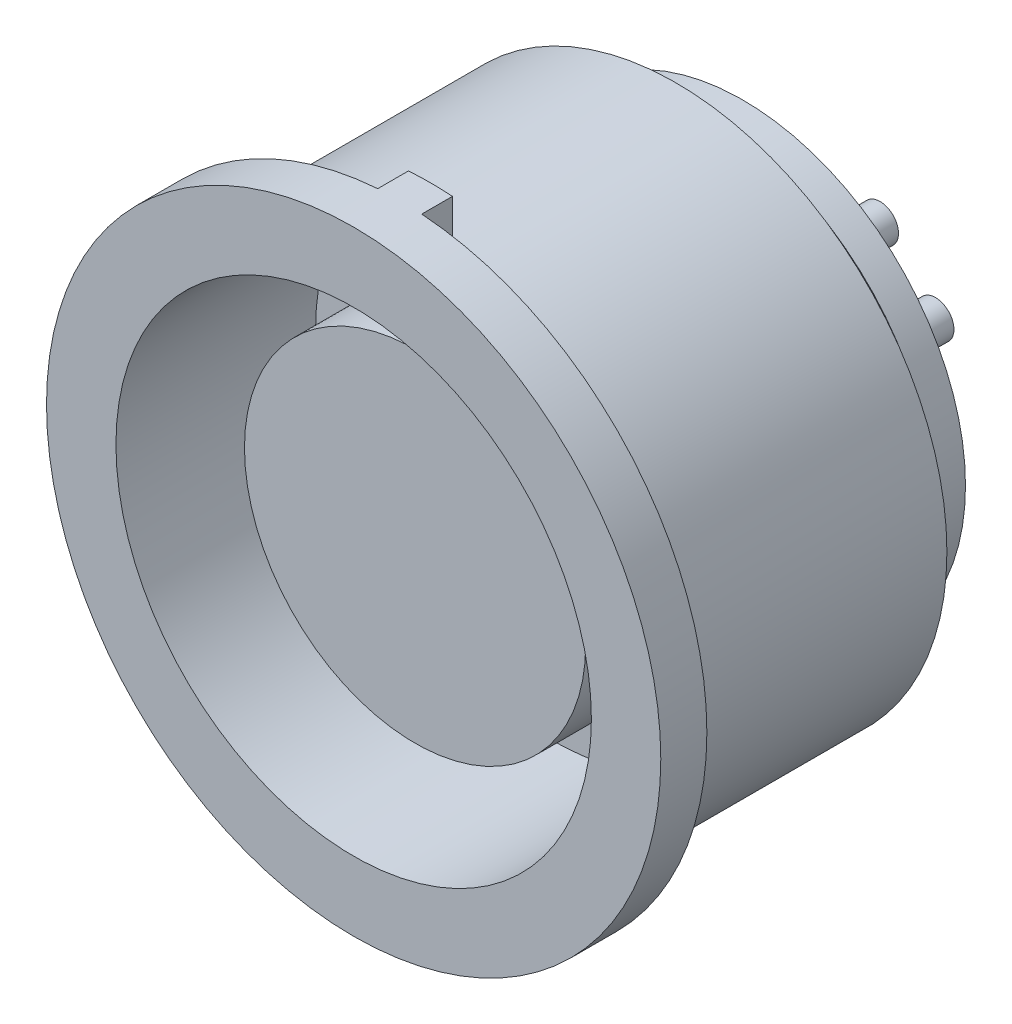
ISO-10303-21;
HEADER;
FILE_DESCRIPTION(('STEP AP214'),'2;1');
FILE_NAME('part.step','',(''),(''),'','','');
FILE_SCHEMA(('AUTOMOTIVE_DESIGN { 1 0 10303 214 1 1 1 1 }'));
ENDSEC;
DATA;
#1=APPLICATION_CONTEXT('core data for automotive mechanical design processes');
#2=APPLICATION_PROTOCOL_DEFINITION('international standard','automotive_design',2000,#1);
#3=PRODUCT_CONTEXT('',#1,'mechanical');
#4=PRODUCT('Part','Part','',(#3));
#5=PRODUCT_RELATED_PRODUCT_CATEGORY('part','',(#4));
#6=PRODUCT_DEFINITION_FORMATION('','',#4);
#7=PRODUCT_DEFINITION_CONTEXT('part definition',#1,'design');
#8=PRODUCT_DEFINITION('design','',#6,#7);
#9=PRODUCT_DEFINITION_SHAPE('','',#8);
#10=(LENGTH_UNIT() NAMED_UNIT(*) SI_UNIT(.MILLI.,.METRE.));
#11=(NAMED_UNIT(*) PLANE_ANGLE_UNIT() SI_UNIT($,.RADIAN.));
#12=(NAMED_UNIT(*) SI_UNIT($,.STERADIAN.) SOLID_ANGLE_UNIT());
#13=UNCERTAINTY_MEASURE_WITH_UNIT(LENGTH_MEASURE(1.E-05),#10,'distance_accuracy_value','');
#14=(GEOMETRIC_REPRESENTATION_CONTEXT(3) GLOBAL_UNCERTAINTY_ASSIGNED_CONTEXT((#13)) GLOBAL_UNIT_ASSIGNED_CONTEXT((#10,
#11,#12)) REPRESENTATION_CONTEXT('',''));
#15=CARTESIAN_POINT('',(0.,0.,0.));
#16=DIRECTION('',(0.,0.,1.));
#17=DIRECTION('',(1.,0.,0.));
#18=AXIS2_PLACEMENT_3D('',#15,#16,#17);
#19=CARTESIAN_POINT('',(0.,0.,11.3571428571429));
#20=DIRECTION('',(0.,0.,1.));
#21=DIRECTION('',(1.,0.,0.));
#22=AXIS2_PLACEMENT_3D('',#19,#20,#21);
#23=CYLINDRICAL_SURFACE('',#22,8.815);
#24=CARTESIAN_POINT('',(0.,0.,-9.));
#25=DIRECTION('',(0.,0.,1.));
#26=DIRECTION('',(1.,0.,0.));
#27=AXIS2_PLACEMENT_3D('',#24,#25,#26);
#28=CIRCLE('',#27,8.815);
#29=CARTESIAN_POINT('',(8.815,0.,-9.));
#30=VERTEX_POINT('',#29);
#31=EDGE_CURVE('E161',#30,#30,#28,.T.);
#32=ORIENTED_EDGE('',*,*,#31,.T.);
#33=EDGE_LOOP('',(#32));
#34=FACE_BOUND('',#33,.T.);
#35=DIRECTION('',(0.,0.,1.));
#36=VECTOR('',#35,1.);
#37=CARTESIAN_POINT('',(0.716714940094325,8.78581497043078,-1.));
#38=LINE('',#37,#36);
#39=CARTESIAN_POINT('',(0.716714940094325,8.78581497043078,-0.999999999999999));
#40=VERTEX_POINT('',#39);
#41=CARTESIAN_POINT('',(0.716714940094325,8.78581497043078,0.));
#42=VERTEX_POINT('',#41);
#43=EDGE_CURVE('E80',#40,#42,#38,.T.);
#44=ORIENTED_EDGE('',*,*,#43,.T.);
#45=CARTESIAN_POINT('',(0.,0.,0.));
#46=DIRECTION('',(0.,0.,1.));
#47=DIRECTION('',(1.,0.,0.));
#48=AXIS2_PLACEMENT_3D('',#45,#46,#47);
#49=CIRCLE('',#48,8.815);
#50=CARTESIAN_POINT('',(-0.716714940094318,8.78581497043078,0.));
#51=VERTEX_POINT('',#50);
#52=EDGE_CURVE('E136',#51,#42,#49,.T.);
#53=ORIENTED_EDGE('',*,*,#52,.F.);
#54=DIRECTION('',(0.,0.,1.));
#55=VECTOR('',#54,1.);
#56=CARTESIAN_POINT('',(-0.716714940094317,8.78581497043078,-1.));
#57=LINE('',#56,#55);
#58=CARTESIAN_POINT('',(-0.716714940094317,8.78581497043078,-0.999999999999999));
#59=VERTEX_POINT('',#58);
#60=EDGE_CURVE('E54',#59,#51,#57,.T.);
#61=ORIENTED_EDGE('',*,*,#60,.F.);
#62=CARTESIAN_POINT('',(0.,0.,-1.));
#63=DIRECTION('',(0.,0.,1.));
#64=DIRECTION('',(-1.,0.,0.));
#65=AXIS2_PLACEMENT_3D('',#62,#63,#64);
#66=CIRCLE('',#65,8.815);
#67=EDGE_CURVE('E49',#40,#59,#66,.T.);
#68=ORIENTED_EDGE('',*,*,#67,.F.);
#69=EDGE_LOOP('',(#44,#53,#61,#68));
#70=FACE_BOUND('',#69,.T.);
#71=ADVANCED_FACE('F35',(#34,#70),#23,.T.);
#72=CARTESIAN_POINT('',(0.,8.815,0.));
#73=DIRECTION('',(0.,0.,1.));
#74=DIRECTION('',(1.,0.,0.));
#75=AXIS2_PLACEMENT_3D('',#72,#73,#74);
#76=PLANE('',#75);
#77=DIRECTION('',(0.,-1.,0.));
#78=VECTOR('',#77,1.);
#79=CARTESIAN_POINT('',(0.716714940094325,9.97428291631261,0.));
#80=LINE('',#79,#78);
#81=CARTESIAN_POINT('',(0.716714940094325,9.97428291631261,0.));
#82=VERTEX_POINT('',#81);
#83=EDGE_CURVE('E245',#82,#42,#80,.T.);
#84=ORIENTED_EDGE('',*,*,#83,.F.);
#85=CARTESIAN_POINT('',(0.,0.,0.));
#86=DIRECTION('',(0.,0.,1.));
#87=DIRECTION('',(1.,0.,0.));
#88=AXIS2_PLACEMENT_3D('',#85,#86,#87);
#89=CIRCLE('',#88,10.);
#90=CARTESIAN_POINT('',(-0.716714940094318,9.97428291631261,0.));
#91=VERTEX_POINT('',#90);
#92=EDGE_CURVE('E95',#91,#82,#89,.T.);
#93=ORIENTED_EDGE('',*,*,#92,.F.);
#94=DIRECTION('',(0.,1.,0.));
#95=VECTOR('',#94,1.);
#96=CARTESIAN_POINT('',(-0.716714940094318,9.97428291631261,0.));
#97=LINE('',#96,#95);
#98=EDGE_CURVE('E91',#51,#91,#97,.T.);
#99=ORIENTED_EDGE('',*,*,#98,.F.);
#100=ORIENTED_EDGE('',*,*,#52,.T.);
#101=EDGE_LOOP('',(#84,#93,#99,#100));
#102=FACE_BOUND('',#101,.T.);
#103=ADVANCED_FACE('F234',(#102),#76,.F.);
#104=CARTESIAN_POINT('',(0.,0.,-10.1308491942857));
#105=DIRECTION('',(0.,0.,1.));
#106=DIRECTION('',(1.,0.,0.));
#107=AXIS2_PLACEMENT_3D('',#104,#105,#106);
#108=CONICAL_SURFACE('',#107,7.25,0.945071369421413);
#109=ORIENTED_EDGE('',*,*,#31,.F.);
#110=EDGE_LOOP('',(#109));
#111=FACE_BOUND('',#110,.T.);
#112=CARTESIAN_POINT('',(0.,0.,-10.1308491942857));
#113=DIRECTION('',(0.,0.,1.));
#114=DIRECTION('',(1.,0.,0.));
#115=AXIS2_PLACEMENT_3D('',#112,#113,#114);
#116=CIRCLE('',#115,7.25);
#117=CARTESIAN_POINT('',(7.25,0.,-10.1308491942857));
#118=VERTEX_POINT('',#117);
#119=EDGE_CURVE('E158',#118,#118,#116,.T.);
#120=ORIENTED_EDGE('',*,*,#119,.T.);
#121=EDGE_LOOP('',(#120));
#122=FACE_BOUND('',#121,.T.);
#123=ADVANCED_FACE('F228',(#111,#122),#108,.T.);
#124=CARTESIAN_POINT('',(0.,0.,11.3571428571429));
#125=DIRECTION('',(0.,0.,1.));
#126=DIRECTION('',(1.,0.,0.));
#127=AXIS2_PLACEMENT_3D('',#124,#125,#126);
#128=CYLINDRICAL_SURFACE('',#127,7.25);
#129=ORIENTED_EDGE('',*,*,#119,.F.);
#130=EDGE_LOOP('',(#129));
#131=FACE_BOUND('',#130,.T.);
#132=CARTESIAN_POINT('',(0.,0.,-11.17));
#133=DIRECTION('',(0.,0.,1.));
#134=DIRECTION('',(1.,0.,0.));
#135=AXIS2_PLACEMENT_3D('',#132,#133,#134);
#136=CIRCLE('',#135,7.25);
#137=CARTESIAN_POINT('',(7.25,0.,-11.17));
#138=VERTEX_POINT('',#137);
#139=EDGE_CURVE('E155',#138,#138,#136,.T.);
#140=ORIENTED_EDGE('',*,*,#139,.T.);
#141=EDGE_LOOP('',(#140));
#142=FACE_BOUND('',#141,.T.);
#143=ADVANCED_FACE('F202',(#131,#142),#128,.T.);
#144=CARTESIAN_POINT('',(0.,7.25,-11.17));
#145=DIRECTION('',(0.,0.,1.));
#146=DIRECTION('',(1.,0.,0.));
#147=AXIS2_PLACEMENT_3D('',#144,#145,#146);
#148=PLANE('',#147);
#149=CARTESIAN_POINT('',(-1.96859885170401,-3.52115951013585,-11.17));
#150=DIRECTION('',(0.,0.,1.));
#151=DIRECTION('',(1.,0.,0.));
#152=AXIS2_PLACEMENT_3D('',#149,#150,#151);
#153=CIRCLE('',#152,0.6);
#154=CARTESIAN_POINT('',(-1.36859885170401,-3.52115951013585,-11.17));
#155=VERTEX_POINT('',#154);
#156=EDGE_CURVE('E11',#155,#155,#153,.F.);
#157=ORIENTED_EDGE('',*,*,#156,.F.);
#158=EDGE_LOOP('',(#157));
#159=FACE_BOUND('',#158,.T.);
#160=CARTESIAN_POINT('',(-1.96859885170399,-1.71395453986632,-11.17));
#161=DIRECTION('',(0.,0.,1.));
#162=DIRECTION('',(1.,0.,0.));
#163=AXIS2_PLACEMENT_3D('',#160,#161,#162);
#164=CIRCLE('',#163,0.6);
#165=CARTESIAN_POINT('',(-1.36859885170399,-1.71395453986632,-11.17));
#166=VERTEX_POINT('',#165);
#167=EDGE_CURVE('E42',#166,#166,#164,.F.);
#168=ORIENTED_EDGE('',*,*,#167,.F.);
#169=EDGE_LOOP('',(#168));
#170=FACE_BOUND('',#169,.T.);
#171=CARTESIAN_POINT('',(-3.77369962281195,-1.7139545398663,-11.17));
#172=DIRECTION('',(0.,0.,1.));
#173=DIRECTION('',(1.,0.,0.));
#174=AXIS2_PLACEMENT_3D('',#171,#172,#173);
#175=CIRCLE('',#174,0.6);
#176=CARTESIAN_POINT('',(-3.17369962281195,-1.7139545398663,-11.17));
#177=VERTEX_POINT('',#176);
#178=EDGE_CURVE('E191',#177,#177,#175,.F.);
#179=ORIENTED_EDGE('',*,*,#178,.F.);
#180=EDGE_LOOP('',(#179));
#181=FACE_BOUND('',#180,.T.);
#182=CARTESIAN_POINT('',(3.52115951013587,-1.96859885170397,-11.17));
#183=DIRECTION('',(0.,0.,1.));
#184=DIRECTION('',(1.,0.,0.));
#185=AXIS2_PLACEMENT_3D('',#182,#183,#184);
#186=CIRCLE('',#185,0.6);
#187=CARTESIAN_POINT('',(4.12115951013587,-1.96859885170397,-11.17));
#188=VERTEX_POINT('',#187);
#189=EDGE_CURVE('E188',#188,#188,#186,.F.);
#190=ORIENTED_EDGE('',*,*,#189,.F.);
#191=EDGE_LOOP('',(#190));
#192=FACE_BOUND('',#191,.T.);
#193=CARTESIAN_POINT('',(1.71395453986634,-1.96859885170397,-11.17));
#194=DIRECTION('',(0.,0.,1.));
#195=DIRECTION('',(1.,0.,0.));
#196=AXIS2_PLACEMENT_3D('',#193,#194,#195);
#197=CIRCLE('',#196,0.6);
#198=CARTESIAN_POINT('',(2.31395453986634,-1.96859885170397,-11.17));
#199=VERTEX_POINT('',#198);
#200=EDGE_CURVE('E185',#199,#199,#197,.F.);
#201=ORIENTED_EDGE('',*,*,#200,.F.);
#202=EDGE_LOOP('',(#201));
#203=FACE_BOUND('',#202,.T.);
#204=CARTESIAN_POINT('',(1.71395453986634,-3.77369962281193,-11.17));
#205=DIRECTION('',(0.,0.,1.));
#206=DIRECTION('',(1.,0.,0.));
#207=AXIS2_PLACEMENT_3D('',#204,#205,#206);
#208=CIRCLE('',#207,0.6);
#209=CARTESIAN_POINT('',(2.31395453986634,-3.77369962281193,-11.17));
#210=VERTEX_POINT('',#209);
#211=EDGE_CURVE('E182',#210,#210,#208,.F.);
#212=ORIENTED_EDGE('',*,*,#211,.F.);
#213=EDGE_LOOP('',(#212));
#214=FACE_BOUND('',#213,.T.);
#215=CARTESIAN_POINT('',(1.96859885170399,3.52115951013587,-11.17));
#216=DIRECTION('',(0.,0.,1.));
#217=DIRECTION('',(1.,0.,0.));
#218=AXIS2_PLACEMENT_3D('',#215,#216,#217);
#219=CIRCLE('',#218,0.6);
#220=CARTESIAN_POINT('',(2.56859885170399,3.52115951013587,-11.17));
#221=VERTEX_POINT('',#220);
#222=EDGE_CURVE('E179',#221,#221,#219,.F.);
#223=ORIENTED_EDGE('',*,*,#222,.F.);
#224=EDGE_LOOP('',(#223));
#225=FACE_BOUND('',#224,.T.);
#226=CARTESIAN_POINT('',(1.96859885170398,1.71395453986633,-11.17));
#227=DIRECTION('',(0.,0.,1.));
#228=DIRECTION('',(1.,0.,0.));
#229=AXIS2_PLACEMENT_3D('',#226,#227,#228);
#230=CIRCLE('',#229,0.6);
#231=CARTESIAN_POINT('',(2.56859885170398,1.71395453986633,-11.17));
#232=VERTEX_POINT('',#231);
#233=EDGE_CURVE('E176',#232,#232,#230,.F.);
#234=ORIENTED_EDGE('',*,*,#233,.F.);
#235=EDGE_LOOP('',(#234));
#236=FACE_BOUND('',#235,.T.);
#237=CARTESIAN_POINT('',(3.77369962281194,1.71395453986632,-11.17));
#238=DIRECTION('',(0.,0.,1.));
#239=DIRECTION('',(1.,0.,0.));
#240=AXIS2_PLACEMENT_3D('',#237,#238,#239);
#241=CIRCLE('',#240,0.6);
#242=CARTESIAN_POINT('',(4.37369962281194,1.71395453986632,-11.17));
#243=VERTEX_POINT('',#242);
#244=EDGE_CURVE('E173',#243,#243,#241,.F.);
#245=ORIENTED_EDGE('',*,*,#244,.F.);
#246=EDGE_LOOP('',(#245));
#247=FACE_BOUND('',#246,.T.);
#248=CARTESIAN_POINT('',(-3.52115951013587,1.96859885170397,-11.17));
#249=DIRECTION('',(0.,0.,1.));
#250=DIRECTION('',(1.,0.,0.));
#251=AXIS2_PLACEMENT_3D('',#248,#249,#250);
#252=CIRCLE('',#251,0.6);
#253=CARTESIAN_POINT('',(-2.92115951013587,1.96859885170397,-11.17));
#254=VERTEX_POINT('',#253);
#255=EDGE_CURVE('E170',#254,#254,#252,.F.);
#256=ORIENTED_EDGE('',*,*,#255,.F.);
#257=EDGE_LOOP('',(#256));
#258=FACE_BOUND('',#257,.T.);
#259=CARTESIAN_POINT('',(-1.71395453986634,1.96859885170397,-11.17));
#260=DIRECTION('',(0.,0.,1.));
#261=DIRECTION('',(1.,0.,0.));
#262=AXIS2_PLACEMENT_3D('',#259,#260,#261);
#263=CIRCLE('',#262,0.6);
#264=CARTESIAN_POINT('',(-1.11395453986634,1.96859885170397,-11.17));
#265=VERTEX_POINT('',#264);
#266=EDGE_CURVE('E167',#265,#265,#263,.F.);
#267=ORIENTED_EDGE('',*,*,#266,.F.);
#268=EDGE_LOOP('',(#267));
#269=FACE_BOUND('',#268,.T.);
#270=CARTESIAN_POINT('',(-1.71395453986634,3.77369962281193,-11.17));
#271=DIRECTION('',(0.,0.,1.));
#272=DIRECTION('',(1.,0.,0.));
#273=AXIS2_PLACEMENT_3D('',#270,#271,#272);
#274=CIRCLE('',#273,0.6);
#275=CARTESIAN_POINT('',(-1.11395453986634,3.77369962281193,-11.17));
#276=VERTEX_POINT('',#275);
#277=EDGE_CURVE('E164',#276,#276,#274,.F.);
#278=ORIENTED_EDGE('',*,*,#277,.F.);
#279=EDGE_LOOP('',(#278));
#280=FACE_BOUND('',#279,.T.);
#281=ORIENTED_EDGE('',*,*,#139,.F.);
#282=EDGE_LOOP('',(#281));
#283=FACE_BOUND('',#282,.T.);
#284=ADVANCED_FACE('F198',(#159,#170,#181,#192,#203,#214,#225,#236,#247,#258,#269,#280,#283),
#148,.F.);
#285=CARTESIAN_POINT('',(0.,5.555,-0.5));
#286=DIRECTION('',(0.,0.,-1.));
#287=DIRECTION('',(-1.,0.,0.));
#288=AXIS2_PLACEMENT_3D('',#285,#286,#287);
#289=PLANE('',#288);
#290=CARTESIAN_POINT('',(0.,0.,-0.5));
#291=DIRECTION('',(0.,0.,1.));
#292=DIRECTION('',(1.,0.,0.));
#293=AXIS2_PLACEMENT_3D('',#290,#291,#292);
#294=CIRCLE('',#293,5.555);
#295=CARTESIAN_POINT('',(5.555,0.,-0.5));
#296=VERTEX_POINT('',#295);
#297=EDGE_CURVE('E152',#296,#296,#294,.T.);
#298=ORIENTED_EDGE('',*,*,#297,.T.);
#299=EDGE_LOOP('',(#298));
#300=FACE_BOUND('',#299,.T.);
#301=ADVANCED_FACE('F201',(#300),#289,.F.);
#302=CARTESIAN_POINT('',(0.,0.,11.3571428571429));
#303=DIRECTION('',(0.,0.,1.));
#304=DIRECTION('',(1.,0.,0.));
#305=AXIS2_PLACEMENT_3D('',#302,#303,#304);
#306=CYLINDRICAL_SURFACE('',#305,5.555);
#307=ORIENTED_EDGE('',*,*,#297,.F.);
#308=EDGE_LOOP('',(#307));
#309=FACE_BOUND('',#308,.T.);
#310=CARTESIAN_POINT('',(0.,0.,-5.));
#311=DIRECTION('',(0.,0.,1.));
#312=DIRECTION('',(1.,0.,0.));
#313=AXIS2_PLACEMENT_3D('',#310,#311,#312);
#314=CIRCLE('',#313,5.555);
#315=CARTESIAN_POINT('',(5.555,0.,-5.));
#316=VERTEX_POINT('',#315);
#317=EDGE_CURVE('E149',#316,#316,#314,.T.);
#318=ORIENTED_EDGE('',*,*,#317,.T.);
#319=EDGE_LOOP('',(#318));
#320=FACE_BOUND('',#319,.T.);
#321=ADVANCED_FACE('F373',(#309,#320),#306,.T.);
#322=CARTESIAN_POINT('',(0.,7.74,-5.));
#323=DIRECTION('',(0.,0.,-1.));
#324=DIRECTION('',(-1.,0.,0.));
#325=AXIS2_PLACEMENT_3D('',#322,#323,#324);
#326=PLANE('',#325);
#327=ORIENTED_EDGE('',*,*,#317,.F.);
#328=EDGE_LOOP('',(#327));
#329=FACE_BOUND('',#328,.T.);
#330=CARTESIAN_POINT('',(0.,0.,-5.));
#331=DIRECTION('',(0.,0.,1.));
#332=DIRECTION('',(1.,0.,0.));
#333=AXIS2_PLACEMENT_3D('',#330,#331,#332);
#334=CIRCLE('',#333,7.74);
#335=CARTESIAN_POINT('',(7.74,0.,-5.));
#336=VERTEX_POINT('',#335);
#337=EDGE_CURVE('E146',#336,#336,#334,.T.);
#338=ORIENTED_EDGE('',*,*,#337,.T.);
#339=EDGE_LOOP('',(#338));
#340=FACE_BOUND('',#339,.T.);
#341=ADVANCED_FACE('F369',(#329,#340),#326,.F.);
#342=CARTESIAN_POINT('',(0.,0.,11.3571428571429));
#343=DIRECTION('',(0.,0.,1.));
#344=DIRECTION('',(1.,0.,0.));
#345=AXIS2_PLACEMENT_3D('',#342,#343,#344);
#346=CYLINDRICAL_SURFACE('',#345,7.74);
#347=ORIENTED_EDGE('',*,*,#337,.F.);
#348=EDGE_LOOP('',(#347));
#349=FACE_BOUND('',#348,.T.);
#350=CARTESIAN_POINT('',(0.,0.,1.5));
#351=DIRECTION('',(0.,0.,1.));
#352=DIRECTION('',(1.,0.,0.));
#353=AXIS2_PLACEMENT_3D('',#350,#351,#352);
#354=CIRCLE('',#353,7.74);
#355=CARTESIAN_POINT('',(7.74,0.,1.5));
#356=VERTEX_POINT('',#355);
#357=EDGE_CURVE('E143',#356,#356,#354,.T.);
#358=ORIENTED_EDGE('',*,*,#357,.T.);
#359=EDGE_LOOP('',(#358));
#360=FACE_BOUND('',#359,.T.);
#361=ADVANCED_FACE('F365',(#349,#360),#346,.F.);
#362=CARTESIAN_POINT('',(0.,10.,1.5));
#363=DIRECTION('',(0.,0.,-1.));
#364=DIRECTION('',(-1.,0.,0.));
#365=AXIS2_PLACEMENT_3D('',#362,#363,#364);
#366=PLANE('',#365);
#367=ORIENTED_EDGE('',*,*,#357,.F.);
#368=EDGE_LOOP('',(#367));
#369=FACE_BOUND('',#368,.T.);
#370=CARTESIAN_POINT('',(0.,0.,1.5));
#371=DIRECTION('',(0.,0.,1.));
#372=DIRECTION('',(1.,0.,0.));
#373=AXIS2_PLACEMENT_3D('',#370,#371,#372);
#374=CIRCLE('',#373,10.);
#375=CARTESIAN_POINT('',(10.,0.,1.5));
#376=VERTEX_POINT('',#375);
#377=EDGE_CURVE('E140',#376,#376,#374,.T.);
#378=ORIENTED_EDGE('',*,*,#377,.T.);
#379=EDGE_LOOP('',(#378));
#380=FACE_BOUND('',#379,.T.);
#381=ADVANCED_FACE('F361',(#369,#380),#366,.F.);
#382=CARTESIAN_POINT('',(0.,0.,11.3571428571429));
#383=DIRECTION('',(0.,0.,1.));
#384=DIRECTION('',(1.,0.,0.));
#385=AXIS2_PLACEMENT_3D('',#382,#383,#384);
#386=CYLINDRICAL_SURFACE('',#385,10.);
#387=ORIENTED_EDGE('',*,*,#377,.F.);
#388=EDGE_LOOP('',(#387));
#389=FACE_BOUND('',#388,.T.);
#390=ORIENTED_EDGE('',*,*,#92,.T.);
#391=DIRECTION('',(0.,0.,1.));
#392=VECTOR('',#391,1.);
#393=CARTESIAN_POINT('',(0.716714940094325,9.97428291631261,-1.));
#394=LINE('',#393,#392);
#395=CARTESIAN_POINT('',(0.716714940094325,9.97428291631261,-1.));
#396=VERTEX_POINT('',#395);
#397=EDGE_CURVE('E79',#396,#82,#394,.T.);
#398=ORIENTED_EDGE('',*,*,#397,.F.);
#399=CARTESIAN_POINT('',(0.,0.,-1.));
#400=DIRECTION('',(0.,0.,-1.));
#401=DIRECTION('',(-1.,0.,0.));
#402=AXIS2_PLACEMENT_3D('',#399,#400,#401);
#403=CIRCLE('',#402,10.);
#404=CARTESIAN_POINT('',(-0.716714940094318,9.97428291631261,-1.));
#405=VERTEX_POINT('',#404);
#406=EDGE_CURVE('E82',#405,#396,#403,.T.);
#407=ORIENTED_EDGE('',*,*,#406,.F.);
#408=DIRECTION('',(0.,0.,1.));
#409=VECTOR('',#408,1.);
#410=CARTESIAN_POINT('',(-0.716714940094318,9.97428291631261,-1.));
#411=LINE('',#410,#409);
#412=EDGE_CURVE('E252',#405,#91,#411,.T.);
#413=ORIENTED_EDGE('',*,*,#412,.T.);
#414=EDGE_LOOP('',(#390,#398,#407,#413));
#415=FACE_BOUND('',#414,.T.);
#416=ADVANCED_FACE('F94',(#389,#415),#386,.T.);
#417=CARTESIAN_POINT('',(-1.71395453986634,3.77369962281193,-13.67));
#418=DIRECTION('',(0.,0.,1.));
#419=DIRECTION('',(1.,0.,0.));
#420=AXIS2_PLACEMENT_3D('',#417,#418,#419);
#421=CYLINDRICAL_SURFACE('',#420,0.6);
#422=CARTESIAN_POINT('',(-1.71395453986634,3.77369962281193,-13.67));
#423=DIRECTION('',(0.,0.,-1.));
#424=DIRECTION('',(-1.,0.,0.));
#425=AXIS2_PLACEMENT_3D('',#422,#423,#424);
#426=CIRCLE('',#425,0.6);
#427=CARTESIAN_POINT('',(-2.31395453986634,3.77369962281193,-13.67));
#428=VERTEX_POINT('',#427);
#429=EDGE_CURVE('E133',#428,#428,#426,.T.);
#430=ORIENTED_EDGE('',*,*,#429,.F.);
#431=EDGE_LOOP('',(#430));
#432=FACE_BOUND('',#431,.T.);
#433=ORIENTED_EDGE('',*,*,#277,.T.);
#434=EDGE_LOOP('',(#433));
#435=FACE_BOUND('',#434,.T.);
#436=ADVANCED_FACE('F354',(#432,#435),#421,.T.);
#437=CARTESIAN_POINT('',(-1.71395453986634,3.77369962281193,-13.67));
#438=DIRECTION('',(0.,0.,-1.));
#439=DIRECTION('',(-1.,0.,0.));
#440=AXIS2_PLACEMENT_3D('',#437,#438,#439);
#441=PLANE('',#440);
#442=ORIENTED_EDGE('',*,*,#429,.T.);
#443=EDGE_LOOP('',(#442));
#444=FACE_BOUND('',#443,.T.);
#445=ADVANCED_FACE('F350',(#444),#441,.T.);
#446=CARTESIAN_POINT('',(-1.71395453986634,1.96859885170397,-13.67));
#447=DIRECTION('',(0.,0.,1.));
#448=DIRECTION('',(1.,0.,0.));
#449=AXIS2_PLACEMENT_3D('',#446,#447,#448);
#450=CYLINDRICAL_SURFACE('',#449,0.6);
#451=CARTESIAN_POINT('',(-1.71395453986634,1.96859885170397,-13.67));
#452=DIRECTION('',(0.,0.,-1.));
#453=DIRECTION('',(-1.,0.,0.));
#454=AXIS2_PLACEMENT_3D('',#451,#452,#453);
#455=CIRCLE('',#454,0.6);
#456=CARTESIAN_POINT('',(-2.31395453986634,1.96859885170397,-13.67));
#457=VERTEX_POINT('',#456);
#458=EDGE_CURVE('E130',#457,#457,#455,.T.);
#459=ORIENTED_EDGE('',*,*,#458,.F.);
#460=EDGE_LOOP('',(#459));
#461=FACE_BOUND('',#460,.T.);
#462=ORIENTED_EDGE('',*,*,#266,.T.);
#463=EDGE_LOOP('',(#462));
#464=FACE_BOUND('',#463,.T.);
#465=ADVANCED_FACE('F346',(#461,#464),#450,.T.);
#466=CARTESIAN_POINT('',(-1.71395453986634,1.96859885170397,-13.67));
#467=DIRECTION('',(0.,0.,-1.));
#468=DIRECTION('',(-1.,0.,0.));
#469=AXIS2_PLACEMENT_3D('',#466,#467,#468);
#470=PLANE('',#469);
#471=ORIENTED_EDGE('',*,*,#458,.T.);
#472=EDGE_LOOP('',(#471));
#473=FACE_BOUND('',#472,.T.);
#474=ADVANCED_FACE('F342',(#473),#470,.T.);
#475=CARTESIAN_POINT('',(-3.52115951013587,1.96859885170397,-13.67));
#476=DIRECTION('',(0.,0.,1.));
#477=DIRECTION('',(1.,0.,0.));
#478=AXIS2_PLACEMENT_3D('',#475,#476,#477);
#479=CYLINDRICAL_SURFACE('',#478,0.6);
#480=CARTESIAN_POINT('',(-3.52115951013587,1.96859885170397,-13.67));
#481=DIRECTION('',(0.,0.,-1.));
#482=DIRECTION('',(-1.,0.,0.));
#483=AXIS2_PLACEMENT_3D('',#480,#481,#482);
#484=CIRCLE('',#483,0.6);
#485=CARTESIAN_POINT('',(-4.12115951013587,1.96859885170397,-13.67));
#486=VERTEX_POINT('',#485);
#487=EDGE_CURVE('E127',#486,#486,#484,.T.);
#488=ORIENTED_EDGE('',*,*,#487,.F.);
#489=EDGE_LOOP('',(#488));
#490=FACE_BOUND('',#489,.T.);
#491=ORIENTED_EDGE('',*,*,#255,.T.);
#492=EDGE_LOOP('',(#491));
#493=FACE_BOUND('',#492,.T.);
#494=ADVANCED_FACE('F338',(#490,#493),#479,.T.);
#495=CARTESIAN_POINT('',(-3.52115951013587,1.96859885170397,-13.67));
#496=DIRECTION('',(0.,0.,-1.));
#497=DIRECTION('',(-1.,0.,0.));
#498=AXIS2_PLACEMENT_3D('',#495,#496,#497);
#499=PLANE('',#498);
#500=ORIENTED_EDGE('',*,*,#487,.T.);
#501=EDGE_LOOP('',(#500));
#502=FACE_BOUND('',#501,.T.);
#503=ADVANCED_FACE('F334',(#502),#499,.T.);
#504=CARTESIAN_POINT('',(3.77369962281194,1.71395453986632,-13.67));
#505=DIRECTION('',(0.,0.,1.));
#506=DIRECTION('',(1.,0.,0.));
#507=AXIS2_PLACEMENT_3D('',#504,#505,#506);
#508=CYLINDRICAL_SURFACE('',#507,0.6);
#509=CARTESIAN_POINT('',(3.77369962281194,1.71395453986632,-13.67));
#510=DIRECTION('',(0.,0.,-1.));
#511=DIRECTION('',(0.,1.,0.));
#512=AXIS2_PLACEMENT_3D('',#509,#510,#511);
#513=CIRCLE('',#512,0.6);
#514=CARTESIAN_POINT('',(3.77369962281194,2.31395453986632,-13.67));
#515=VERTEX_POINT('',#514);
#516=EDGE_CURVE('E124',#515,#515,#513,.T.);
#517=ORIENTED_EDGE('',*,*,#516,.F.);
#518=EDGE_LOOP('',(#517));
#519=FACE_BOUND('',#518,.T.);
#520=ORIENTED_EDGE('',*,*,#244,.T.);
#521=EDGE_LOOP('',(#520));
#522=FACE_BOUND('',#521,.T.);
#523=ADVANCED_FACE('F330',(#519,#522),#508,.T.);
#524=CARTESIAN_POINT('',(3.77369962281194,1.71395453986632,-13.67));
#525=DIRECTION('',(0.,0.,-1.));
#526=DIRECTION('',(0.,1.,0.));
#527=AXIS2_PLACEMENT_3D('',#524,#525,#526);
#528=PLANE('',#527);
#529=ORIENTED_EDGE('',*,*,#516,.T.);
#530=EDGE_LOOP('',(#529));
#531=FACE_BOUND('',#530,.T.);
#532=ADVANCED_FACE('F326',(#531),#528,.T.);
#533=CARTESIAN_POINT('',(1.96859885170398,1.71395453986633,-13.67));
#534=DIRECTION('',(0.,0.,1.));
#535=DIRECTION('',(1.,0.,0.));
#536=AXIS2_PLACEMENT_3D('',#533,#534,#535);
#537=CYLINDRICAL_SURFACE('',#536,0.6);
#538=CARTESIAN_POINT('',(1.96859885170398,1.71395453986633,-13.67));
#539=DIRECTION('',(0.,0.,-1.));
#540=DIRECTION('',(0.,1.,0.));
#541=AXIS2_PLACEMENT_3D('',#538,#539,#540);
#542=CIRCLE('',#541,0.6);
#543=CARTESIAN_POINT('',(1.96859885170398,2.31395453986633,-13.67));
#544=VERTEX_POINT('',#543);
#545=EDGE_CURVE('E121',#544,#544,#542,.T.);
#546=ORIENTED_EDGE('',*,*,#545,.F.);
#547=EDGE_LOOP('',(#546));
#548=FACE_BOUND('',#547,.T.);
#549=ORIENTED_EDGE('',*,*,#233,.T.);
#550=EDGE_LOOP('',(#549));
#551=FACE_BOUND('',#550,.T.);
#552=ADVANCED_FACE('F322',(#548,#551),#537,.T.);
#553=CARTESIAN_POINT('',(1.96859885170398,1.71395453986633,-13.67));
#554=DIRECTION('',(0.,0.,-1.));
#555=DIRECTION('',(0.,1.,0.));
#556=AXIS2_PLACEMENT_3D('',#553,#554,#555);
#557=PLANE('',#556);
#558=ORIENTED_EDGE('',*,*,#545,.T.);
#559=EDGE_LOOP('',(#558));
#560=FACE_BOUND('',#559,.T.);
#561=ADVANCED_FACE('F318',(#560),#557,.T.);
#562=CARTESIAN_POINT('',(1.96859885170399,3.52115951013587,-13.67));
#563=DIRECTION('',(0.,0.,1.));
#564=DIRECTION('',(1.,0.,0.));
#565=AXIS2_PLACEMENT_3D('',#562,#563,#564);
#566=CYLINDRICAL_SURFACE('',#565,0.6);
#567=CARTESIAN_POINT('',(1.96859885170399,3.52115951013587,-13.67));
#568=DIRECTION('',(0.,0.,-1.));
#569=DIRECTION('',(0.,1.,0.));
#570=AXIS2_PLACEMENT_3D('',#567,#568,#569);
#571=CIRCLE('',#570,0.6);
#572=CARTESIAN_POINT('',(1.96859885170399,4.12115951013587,-13.67));
#573=VERTEX_POINT('',#572);
#574=EDGE_CURVE('E118',#573,#573,#571,.T.);
#575=ORIENTED_EDGE('',*,*,#574,.F.);
#576=EDGE_LOOP('',(#575));
#577=FACE_BOUND('',#576,.T.);
#578=ORIENTED_EDGE('',*,*,#222,.T.);
#579=EDGE_LOOP('',(#578));
#580=FACE_BOUND('',#579,.T.);
#581=ADVANCED_FACE('F314',(#577,#580),#566,.T.);
#582=CARTESIAN_POINT('',(1.96859885170399,3.52115951013587,-13.67));
#583=DIRECTION('',(0.,0.,-1.));
#584=DIRECTION('',(0.,1.,0.));
#585=AXIS2_PLACEMENT_3D('',#582,#583,#584);
#586=PLANE('',#585);
#587=ORIENTED_EDGE('',*,*,#574,.T.);
#588=EDGE_LOOP('',(#587));
#589=FACE_BOUND('',#588,.T.);
#590=ADVANCED_FACE('F310',(#589),#586,.T.);
#591=CARTESIAN_POINT('',(1.71395453986634,-3.77369962281193,-13.67));
#592=DIRECTION('',(0.,0.,1.));
#593=DIRECTION('',(1.,0.,0.));
#594=AXIS2_PLACEMENT_3D('',#591,#592,#593);
#595=CYLINDRICAL_SURFACE('',#594,0.6);
#596=CARTESIAN_POINT('',(1.71395453986634,-3.77369962281193,-13.67));
#597=DIRECTION('',(0.,0.,-1.));
#598=DIRECTION('',(1.,0.,0.));
#599=AXIS2_PLACEMENT_3D('',#596,#597,#598);
#600=CIRCLE('',#599,0.6);
#601=CARTESIAN_POINT('',(2.31395453986634,-3.77369962281193,-13.67));
#602=VERTEX_POINT('',#601);
#603=EDGE_CURVE('E115',#602,#602,#600,.T.);
#604=ORIENTED_EDGE('',*,*,#603,.F.);
#605=EDGE_LOOP('',(#604));
#606=FACE_BOUND('',#605,.T.);
#607=ORIENTED_EDGE('',*,*,#211,.T.);
#608=EDGE_LOOP('',(#607));
#609=FACE_BOUND('',#608,.T.);
#610=ADVANCED_FACE('F306',(#606,#609),#595,.T.);
#611=CARTESIAN_POINT('',(1.71395453986634,-3.77369962281193,-13.67));
#612=DIRECTION('',(0.,0.,-1.));
#613=DIRECTION('',(1.,0.,0.));
#614=AXIS2_PLACEMENT_3D('',#611,#612,#613);
#615=PLANE('',#614);
#616=ORIENTED_EDGE('',*,*,#603,.T.);
#617=EDGE_LOOP('',(#616));
#618=FACE_BOUND('',#617,.T.);
#619=ADVANCED_FACE('F302',(#618),#615,.T.);
#620=CARTESIAN_POINT('',(1.71395453986634,-1.96859885170397,-13.67));
#621=DIRECTION('',(0.,0.,1.));
#622=DIRECTION('',(1.,0.,0.));
#623=AXIS2_PLACEMENT_3D('',#620,#621,#622);
#624=CYLINDRICAL_SURFACE('',#623,0.6);
#625=CARTESIAN_POINT('',(1.71395453986634,-1.96859885170397,-13.67));
#626=DIRECTION('',(0.,0.,-1.));
#627=DIRECTION('',(1.,0.,0.));
#628=AXIS2_PLACEMENT_3D('',#625,#626,#627);
#629=CIRCLE('',#628,0.6);
#630=CARTESIAN_POINT('',(2.31395453986634,-1.96859885170397,-13.67));
#631=VERTEX_POINT('',#630);
#632=EDGE_CURVE('E112',#631,#631,#629,.T.);
#633=ORIENTED_EDGE('',*,*,#632,.F.);
#634=EDGE_LOOP('',(#633));
#635=FACE_BOUND('',#634,.T.);
#636=ORIENTED_EDGE('',*,*,#200,.T.);
#637=EDGE_LOOP('',(#636));
#638=FACE_BOUND('',#637,.T.);
#639=ADVANCED_FACE('F298',(#635,#638),#624,.T.);
#640=CARTESIAN_POINT('',(1.71395453986634,-1.96859885170397,-13.67));
#641=DIRECTION('',(0.,0.,-1.));
#642=DIRECTION('',(1.,0.,0.));
#643=AXIS2_PLACEMENT_3D('',#640,#641,#642);
#644=PLANE('',#643);
#645=ORIENTED_EDGE('',*,*,#632,.T.);
#646=EDGE_LOOP('',(#645));
#647=FACE_BOUND('',#646,.T.);
#648=ADVANCED_FACE('F294',(#647),#644,.T.);
#649=CARTESIAN_POINT('',(3.52115951013587,-1.96859885170397,-13.67));
#650=DIRECTION('',(0.,0.,1.));
#651=DIRECTION('',(1.,0.,0.));
#652=AXIS2_PLACEMENT_3D('',#649,#650,#651);
#653=CYLINDRICAL_SURFACE('',#652,0.6);
#654=CARTESIAN_POINT('',(3.52115951013587,-1.96859885170397,-13.67));
#655=DIRECTION('',(0.,0.,-1.));
#656=DIRECTION('',(1.,0.,0.));
#657=AXIS2_PLACEMENT_3D('',#654,#655,#656);
#658=CIRCLE('',#657,0.6);
#659=CARTESIAN_POINT('',(4.12115951013587,-1.96859885170397,-13.67));
#660=VERTEX_POINT('',#659);
#661=EDGE_CURVE('E109',#660,#660,#658,.T.);
#662=ORIENTED_EDGE('',*,*,#661,.F.);
#663=EDGE_LOOP('',(#662));
#664=FACE_BOUND('',#663,.T.);
#665=ORIENTED_EDGE('',*,*,#189,.T.);
#666=EDGE_LOOP('',(#665));
#667=FACE_BOUND('',#666,.T.);
#668=ADVANCED_FACE('F290',(#664,#667),#653,.T.);
#669=CARTESIAN_POINT('',(3.52115951013587,-1.96859885170397,-13.67));
#670=DIRECTION('',(0.,0.,-1.));
#671=DIRECTION('',(1.,0.,0.));
#672=AXIS2_PLACEMENT_3D('',#669,#670,#671);
#673=PLANE('',#672);
#674=ORIENTED_EDGE('',*,*,#661,.T.);
#675=EDGE_LOOP('',(#674));
#676=FACE_BOUND('',#675,.T.);
#677=ADVANCED_FACE('F286',(#676),#673,.T.);
#678=CARTESIAN_POINT('',(-3.77369962281195,-1.7139545398663,-13.67));
#679=DIRECTION('',(0.,0.,1.));
#680=DIRECTION('',(1.,0.,0.));
#681=AXIS2_PLACEMENT_3D('',#678,#679,#680);
#682=CYLINDRICAL_SURFACE('',#681,0.6);
#683=CARTESIAN_POINT('',(-3.77369962281195,-1.7139545398663,-13.67));
#684=DIRECTION('',(0.,0.,-1.));
#685=DIRECTION('',(0.,-1.,0.));
#686=AXIS2_PLACEMENT_3D('',#683,#684,#685);
#687=CIRCLE('',#686,0.6);
#688=CARTESIAN_POINT('',(-3.77369962281196,-2.3139545398663,-13.67));
#689=VERTEX_POINT('',#688);
#690=EDGE_CURVE('E106',#689,#689,#687,.T.);
#691=ORIENTED_EDGE('',*,*,#690,.F.);
#692=EDGE_LOOP('',(#691));
#693=FACE_BOUND('',#692,.T.);
#694=ORIENTED_EDGE('',*,*,#178,.T.);
#695=EDGE_LOOP('',(#694));
#696=FACE_BOUND('',#695,.T.);
#697=ADVANCED_FACE('F282',(#693,#696),#682,.T.);
#698=CARTESIAN_POINT('',(-3.77369962281195,-1.7139545398663,-13.67));
#699=DIRECTION('',(0.,0.,-1.));
#700=DIRECTION('',(0.,-1.,0.));
#701=AXIS2_PLACEMENT_3D('',#698,#699,#700);
#702=PLANE('',#701);
#703=ORIENTED_EDGE('',*,*,#690,.T.);
#704=EDGE_LOOP('',(#703));
#705=FACE_BOUND('',#704,.T.);
#706=ADVANCED_FACE('F278',(#705),#702,.T.);
#707=CARTESIAN_POINT('',(-1.96859885170399,-1.71395453986632,-13.67));
#708=DIRECTION('',(0.,0.,1.));
#709=DIRECTION('',(1.,0.,0.));
#710=AXIS2_PLACEMENT_3D('',#707,#708,#709);
#711=CYLINDRICAL_SURFACE('',#710,0.6);
#712=CARTESIAN_POINT('',(-1.96859885170399,-1.71395453986632,-13.67));
#713=DIRECTION('',(0.,0.,-1.));
#714=DIRECTION('',(0.,-1.,0.));
#715=AXIS2_PLACEMENT_3D('',#712,#713,#714);
#716=CIRCLE('',#715,0.6);
#717=CARTESIAN_POINT('',(-1.968598851704,-2.31395453986632,-13.67));
#718=VERTEX_POINT('',#717);
#719=EDGE_CURVE('E99',#718,#718,#716,.T.);
#720=ORIENTED_EDGE('',*,*,#719,.F.);
#721=EDGE_LOOP('',(#720));
#722=FACE_BOUND('',#721,.T.);
#723=ORIENTED_EDGE('',*,*,#167,.T.);
#724=EDGE_LOOP('',(#723));
#725=FACE_BOUND('',#724,.T.);
#726=ADVANCED_FACE('F196',(#722,#725),#711,.T.);
#727=CARTESIAN_POINT('',(-1.96859885170399,-1.71395453986632,-13.67));
#728=DIRECTION('',(0.,0.,-1.));
#729=DIRECTION('',(0.,-1.,0.));
#730=AXIS2_PLACEMENT_3D('',#727,#728,#729);
#731=PLANE('',#730);
#732=ORIENTED_EDGE('',*,*,#719,.T.);
#733=EDGE_LOOP('',(#732));
#734=FACE_BOUND('',#733,.T.);
#735=ADVANCED_FACE('F271',(#734),#731,.T.);
#736=CARTESIAN_POINT('',(-1.96859885170401,-3.52115951013585,-13.67));
#737=DIRECTION('',(0.,0.,1.));
#738=DIRECTION('',(1.,0.,0.));
#739=AXIS2_PLACEMENT_3D('',#736,#737,#738);
#740=CYLINDRICAL_SURFACE('',#739,0.6);
#741=CARTESIAN_POINT('',(-1.96859885170401,-3.52115951013585,-13.67));
#742=DIRECTION('',(0.,0.,-1.));
#743=DIRECTION('',(0.,-1.,0.));
#744=AXIS2_PLACEMENT_3D('',#741,#742,#743);
#745=CIRCLE('',#744,0.6);
#746=CARTESIAN_POINT('',(-1.96859885170402,-4.12115951013585,-13.67));
#747=VERTEX_POINT('',#746);
#748=EDGE_CURVE('E96',#747,#747,#745,.T.);
#749=ORIENTED_EDGE('',*,*,#748,.F.);
#750=EDGE_LOOP('',(#749));
#751=FACE_BOUND('',#750,.T.);
#752=ORIENTED_EDGE('',*,*,#156,.T.);
#753=EDGE_LOOP('',(#752));
#754=FACE_BOUND('',#753,.T.);
#755=ADVANCED_FACE('F267',(#751,#754),#740,.T.);
#756=CARTESIAN_POINT('',(-1.96859885170401,-3.52115951013585,-13.67));
#757=DIRECTION('',(0.,0.,-1.));
#758=DIRECTION('',(0.,-1.,0.));
#759=AXIS2_PLACEMENT_3D('',#756,#757,#758);
#760=PLANE('',#759);
#761=ORIENTED_EDGE('',*,*,#748,.T.);
#762=EDGE_LOOP('',(#761));
#763=FACE_BOUND('',#762,.T.);
#764=ADVANCED_FACE('F262',(#763),#760,.T.);
#765=CARTESIAN_POINT('',(0.716714940094325,9.97428291631261,-1.));
#766=DIRECTION('',(-1.,0.,0.));
#767=DIRECTION('',(0.,0.,1.));
#768=AXIS2_PLACEMENT_3D('',#765,#766,#767);
#769=PLANE('',#768);
#770=ORIENTED_EDGE('',*,*,#83,.T.);
#771=ORIENTED_EDGE('',*,*,#43,.F.);
#772=DIRECTION('',(0.,-1.,0.));
#773=VECTOR('',#772,1.);
#774=CARTESIAN_POINT('',(0.716714940094325,9.97428291631261,-1.));
#775=LINE('',#774,#773);
#776=EDGE_CURVE('E74',#396,#40,#775,.T.);
#777=ORIENTED_EDGE('',*,*,#776,.F.);
#778=ORIENTED_EDGE('',*,*,#397,.T.);
#779=EDGE_LOOP('',(#770,#771,#777,#778));
#780=FACE_BOUND('',#779,.T.);
#781=ADVANCED_FACE('F77',(#780),#769,.F.);
#782=CARTESIAN_POINT('',(-0.716714940094318,9.97428291631261,-1.));
#783=DIRECTION('',(1.,0.,0.));
#784=DIRECTION('',(0.,1.,0.));
#785=AXIS2_PLACEMENT_3D('',#782,#783,#784);
#786=PLANE('',#785);
#787=ORIENTED_EDGE('',*,*,#98,.T.);
#788=ORIENTED_EDGE('',*,*,#412,.F.);
#789=DIRECTION('',(0.,1.,0.));
#790=VECTOR('',#789,1.);
#791=CARTESIAN_POINT('',(-0.716714940094318,9.97428291631261,-1.));
#792=LINE('',#791,#790);
#793=EDGE_CURVE('E87',#59,#405,#792,.T.);
#794=ORIENTED_EDGE('',*,*,#793,.F.);
#795=ORIENTED_EDGE('',*,*,#60,.T.);
#796=EDGE_LOOP('',(#787,#788,#794,#795));
#797=FACE_BOUND('',#796,.T.);
#798=ADVANCED_FACE('F254',(#797),#786,.F.);
#799=CARTESIAN_POINT('',(0.,0.,-1.));
#800=DIRECTION('',(0.,0.,-1.));
#801=DIRECTION('',(-1.,0.,0.));
#802=AXIS2_PLACEMENT_3D('',#799,#800,#801);
#803=PLANE('',#802);
#804=ORIENTED_EDGE('',*,*,#406,.T.);
#805=ORIENTED_EDGE('',*,*,#776,.T.);
#806=ORIENTED_EDGE('',*,*,#67,.T.);
#807=ORIENTED_EDGE('',*,*,#793,.T.);
#808=EDGE_LOOP('',(#804,#805,#806,#807));
#809=FACE_BOUND('',#808,.T.);
#810=ADVANCED_FACE('F85',(#809),#803,.T.);
#811=CLOSED_SHELL('',(#71,#103,#123,#143,#284,#301,#321,#341,#361,#381,#416,#436,#445,#465,#474,
#494,#503,#523,#532,#552,#561,#581,#590,#610,#619,#639,#648,#668,#677,#697,#706,#726,#735,#755,
#764,#781,#798,#810));
#812=MANIFOLD_SOLID_BREP('B2',#811);
#813=ADVANCED_BREP_SHAPE_REPRESENTATION('',(#18,#812),#14);
#814=SHAPE_DEFINITION_REPRESENTATION(#9,#813);
ENDSEC;
END-ISO-10303-21;
